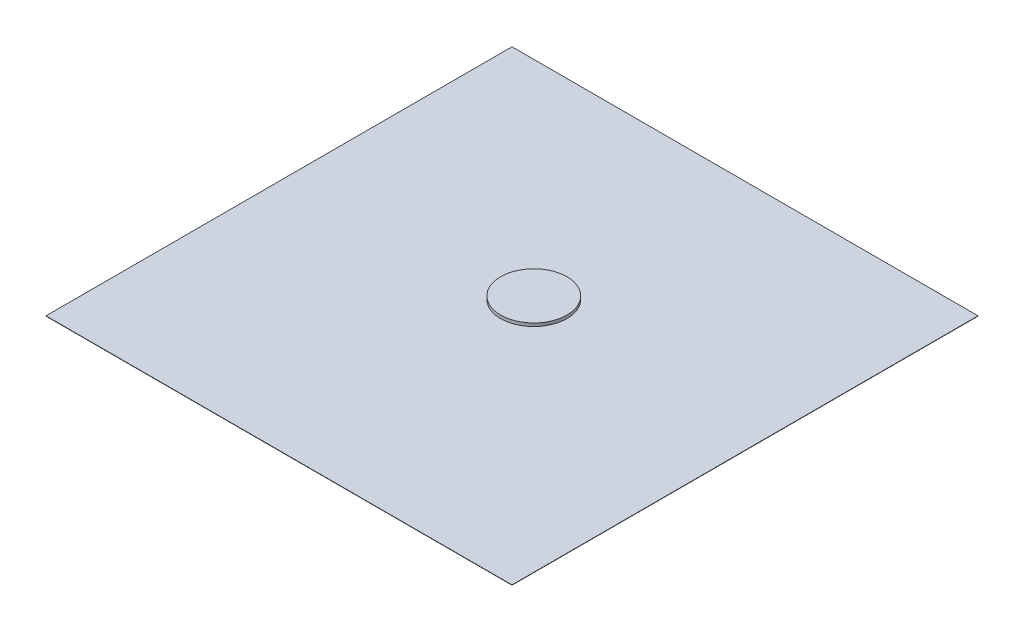
ISO-10303-21;
HEADER;
FILE_DESCRIPTION(('STEP AP214'),'2;1');
FILE_NAME('part.step','',(''),(''),'','','');
FILE_SCHEMA(('AUTOMOTIVE_DESIGN { 1 0 10303 214 1 1 1 1 }'));
ENDSEC;
DATA;
#1=APPLICATION_CONTEXT('core data for automotive mechanical design processes');
#2=APPLICATION_PROTOCOL_DEFINITION('international standard','automotive_design',2000,#1);
#3=PRODUCT_CONTEXT('',#1,'mechanical');
#4=PRODUCT('Part','Part','',(#3));
#5=PRODUCT_RELATED_PRODUCT_CATEGORY('part','',(#4));
#6=PRODUCT_DEFINITION_FORMATION('','',#4);
#7=PRODUCT_DEFINITION_CONTEXT('part definition',#1,'design');
#8=PRODUCT_DEFINITION('design','',#6,#7);
#9=PRODUCT_DEFINITION_SHAPE('','',#8);
#10=(LENGTH_UNIT() NAMED_UNIT(*) SI_UNIT(.MILLI.,.METRE.));
#11=(NAMED_UNIT(*) PLANE_ANGLE_UNIT() SI_UNIT($,.RADIAN.));
#12=(NAMED_UNIT(*) SI_UNIT($,.STERADIAN.) SOLID_ANGLE_UNIT());
#13=UNCERTAINTY_MEASURE_WITH_UNIT(LENGTH_MEASURE(1.E-05),#10,'distance_accuracy_value','');
#14=(GEOMETRIC_REPRESENTATION_CONTEXT(3) GLOBAL_UNCERTAINTY_ASSIGNED_CONTEXT((#13)) GLOBAL_UNIT_ASSIGNED_CONTEXT((#10,
#11,#12)) REPRESENTATION_CONTEXT('',''));
#15=CARTESIAN_POINT('',(0.,0.,0.));
#16=DIRECTION('',(0.,0.,1.));
#17=DIRECTION('',(1.,0.,0.));
#18=AXIS2_PLACEMENT_3D('',#15,#16,#17);
#19=CARTESIAN_POINT('',(0.,1.,0.));
#20=DIRECTION('',(1.,0.,0.));
#21=DIRECTION('',(0.,0.,-1.));
#22=AXIS2_PLACEMENT_3D('',#19,#20,#21);
#23=PLANE('',#22);
#24=DIRECTION('',(0.,0.,1.));
#25=VECTOR('',#24,1.);
#26=CARTESIAN_POINT('',(0.,0.,0.));
#27=LINE('',#26,#25);
#28=CARTESIAN_POINT('',(0.,0.,-1500.));
#29=VERTEX_POINT('',#28);
#30=CARTESIAN_POINT('',(0.,0.,0.));
#31=VERTEX_POINT('',#30);
#32=EDGE_CURVE('E105',#29,#31,#27,.T.);
#33=ORIENTED_EDGE('',*,*,#32,.T.);
#34=DIRECTION('',(0.,-1.,0.));
#35=VECTOR('',#34,1.);
#36=CARTESIAN_POINT('',(0.,1.,0.));
#37=LINE('',#36,#35);
#38=CARTESIAN_POINT('',(0.,1.,0.));
#39=VERTEX_POINT('',#38);
#40=EDGE_CURVE('E47',#39,#31,#37,.T.);
#41=ORIENTED_EDGE('',*,*,#40,.F.);
#42=DIRECTION('',(0.,0.,1.));
#43=VECTOR('',#42,1.);
#44=CARTESIAN_POINT('',(0.,1.,0.));
#45=LINE('',#44,#43);
#46=CARTESIAN_POINT('',(0.,1.,-1500.));
#47=VERTEX_POINT('',#46);
#48=EDGE_CURVE('E91',#47,#39,#45,.T.);
#49=ORIENTED_EDGE('',*,*,#48,.F.);
#50=DIRECTION('',(0.,-1.,0.));
#51=VECTOR('',#50,1.);
#52=CARTESIAN_POINT('',(0.,1.,-1500.));
#53=LINE('',#52,#51);
#54=EDGE_CURVE('E101',#47,#29,#53,.T.);
#55=ORIENTED_EDGE('',*,*,#54,.T.);
#56=EDGE_LOOP('',(#33,#41,#49,#55));
#57=FACE_BOUND('',#56,.T.);
#58=ADVANCED_FACE('F39',(#57),#23,.F.);
#59=CARTESIAN_POINT('',(0.,1.,0.));
#60=DIRECTION('',(0.,0.,-1.));
#61=DIRECTION('',(-1.,0.,0.));
#62=AXIS2_PLACEMENT_3D('',#59,#60,#61);
#63=PLANE('',#62);
#64=DIRECTION('',(1.,0.,0.));
#65=VECTOR('',#64,1.);
#66=CARTESIAN_POINT('',(0.,0.,0.));
#67=LINE('',#66,#65);
#68=CARTESIAN_POINT('',(1500.,0.,0.));
#69=VERTEX_POINT('',#68);
#70=EDGE_CURVE('E96',#31,#69,#67,.T.);
#71=ORIENTED_EDGE('',*,*,#70,.T.);
#72=DIRECTION('',(0.,-1.,0.));
#73=VECTOR('',#72,1.);
#74=CARTESIAN_POINT('',(1500.,1.,0.));
#75=LINE('',#74,#73);
#76=CARTESIAN_POINT('',(1500.,1.,0.));
#77=VERTEX_POINT('',#76);
#78=EDGE_CURVE('E94',#77,#69,#75,.T.);
#79=ORIENTED_EDGE('',*,*,#78,.F.);
#80=DIRECTION('',(1.,0.,0.));
#81=VECTOR('',#80,1.);
#82=CARTESIAN_POINT('',(0.,1.,0.));
#83=LINE('',#82,#81);
#84=EDGE_CURVE('E86',#39,#77,#83,.T.);
#85=ORIENTED_EDGE('',*,*,#84,.F.);
#86=ORIENTED_EDGE('',*,*,#40,.T.);
#87=EDGE_LOOP('',(#71,#79,#85,#86));
#88=FACE_BOUND('',#87,.T.);
#89=ADVANCED_FACE('F95',(#88),#63,.F.);
#90=CARTESIAN_POINT('',(1500.,1.,0.));
#91=DIRECTION('',(-1.,0.,0.));
#92=DIRECTION('',(0.,0.,1.));
#93=AXIS2_PLACEMENT_3D('',#90,#91,#92);
#94=PLANE('',#93);
#95=DIRECTION('',(0.,0.,-1.));
#96=VECTOR('',#95,1.);
#97=CARTESIAN_POINT('',(1500.,0.,0.));
#98=LINE('',#97,#96);
#99=CARTESIAN_POINT('',(1500.,0.,-1500.));
#100=VERTEX_POINT('',#99);
#101=EDGE_CURVE('E72',#69,#100,#98,.T.);
#102=ORIENTED_EDGE('',*,*,#101,.T.);
#103=DIRECTION('',(0.,-1.,0.));
#104=VECTOR('',#103,1.);
#105=CARTESIAN_POINT('',(1500.,1.,-1500.));
#106=LINE('',#105,#104);
#107=CARTESIAN_POINT('',(1500.,1.,-1500.));
#108=VERTEX_POINT('',#107);
#109=EDGE_CURVE('E97',#108,#100,#106,.T.);
#110=ORIENTED_EDGE('',*,*,#109,.F.);
#111=DIRECTION('',(0.,0.,-1.));
#112=VECTOR('',#111,1.);
#113=CARTESIAN_POINT('',(1500.,1.,0.));
#114=LINE('',#113,#112);
#115=EDGE_CURVE('E89',#77,#108,#114,.T.);
#116=ORIENTED_EDGE('',*,*,#115,.F.);
#117=ORIENTED_EDGE('',*,*,#78,.T.);
#118=EDGE_LOOP('',(#102,#110,#116,#117));
#119=FACE_BOUND('',#118,.T.);
#120=ADVANCED_FACE('F99',(#119),#94,.F.);
#121=CARTESIAN_POINT('',(0.,1.,-1500.));
#122=DIRECTION('',(0.,0.,1.));
#123=DIRECTION('',(1.,0.,0.));
#124=AXIS2_PLACEMENT_3D('',#121,#122,#123);
#125=PLANE('',#124);
#126=DIRECTION('',(-1.,0.,0.));
#127=VECTOR('',#126,1.);
#128=CARTESIAN_POINT('',(0.,0.,-1500.));
#129=LINE('',#128,#127);
#130=EDGE_CURVE('E78',#100,#29,#129,.T.);
#131=ORIENTED_EDGE('',*,*,#130,.T.);
#132=ORIENTED_EDGE('',*,*,#54,.F.);
#133=DIRECTION('',(-1.,0.,0.));
#134=VECTOR('',#133,1.);
#135=CARTESIAN_POINT('',(0.,1.,-1500.));
#136=LINE('',#135,#134);
#137=EDGE_CURVE('E55',#108,#47,#136,.T.);
#138=ORIENTED_EDGE('',*,*,#137,.F.);
#139=ORIENTED_EDGE('',*,*,#109,.T.);
#140=EDGE_LOOP('',(#131,#132,#138,#139));
#141=FACE_BOUND('',#140,.T.);
#142=ADVANCED_FACE('F128',(#141),#125,.F.);
#143=CARTESIAN_POINT('',(0.,1.,0.));
#144=DIRECTION('',(0.,-1.,0.));
#145=DIRECTION('',(0.,0.,-1.));
#146=AXIS2_PLACEMENT_3D('',#143,#144,#145);
#147=PLANE('',#146);
#148=CARTESIAN_POINT('',(739.52799832448,1.,-830.634412901506));
#149=DIRECTION('',(0.,-1.,0.));
#150=DIRECTION('',(0.,0.,-1.));
#151=AXIS2_PLACEMENT_3D('',#148,#149,#150);
#152=CIRCLE('',#151,106.814417090307);
#153=CARTESIAN_POINT('',(739.52799832448,1.,-937.448829991813));
#154=VERTEX_POINT('',#153);
#155=EDGE_CURVE('E11',#154,#154,#152,.F.);
#156=ORIENTED_EDGE('',*,*,#155,.F.);
#157=EDGE_LOOP('',(#156));
#158=FACE_BOUND('',#157,.T.);
#159=ORIENTED_EDGE('',*,*,#48,.T.);
#160=ORIENTED_EDGE('',*,*,#84,.T.);
#161=ORIENTED_EDGE('',*,*,#115,.T.);
#162=ORIENTED_EDGE('',*,*,#137,.T.);
#163=EDGE_LOOP('',(#159,#160,#161,#162));
#164=FACE_BOUND('',#163,.T.);
#165=ADVANCED_FACE('F87',(#158,#164),#147,.F.);
#166=CARTESIAN_POINT('',(0.,0.,0.));
#167=DIRECTION('',(0.,-1.,0.));
#168=DIRECTION('',(0.,0.,-1.));
#169=AXIS2_PLACEMENT_3D('',#166,#167,#168);
#170=PLANE('',#169);
#171=ORIENTED_EDGE('',*,*,#32,.F.);
#172=ORIENTED_EDGE('',*,*,#130,.F.);
#173=ORIENTED_EDGE('',*,*,#101,.F.);
#174=ORIENTED_EDGE('',*,*,#70,.F.);
#175=EDGE_LOOP('',(#171,#172,#173,#174));
#176=FACE_BOUND('',#175,.T.);
#177=ADVANCED_FACE('F116',(#176),#170,.T.);
#178=CARTESIAN_POINT('',(739.52799832448,11.,-830.634412901506));
#179=DIRECTION('',(0.,-1.,0.));
#180=DIRECTION('',(0.,0.,-1.));
#181=AXIS2_PLACEMENT_3D('',#178,#179,#180);
#182=CYLINDRICAL_SURFACE('',#181,106.814417090307);
#183=CARTESIAN_POINT('',(739.52799832448,11.,-830.634412901506));
#184=DIRECTION('',(0.,1.,0.));
#185=DIRECTION('',(0.,0.,1.));
#186=AXIS2_PLACEMENT_3D('',#183,#184,#185);
#187=CIRCLE('',#186,106.814417090307);
#188=CARTESIAN_POINT('',(739.52799832448,11.,-723.819995811199));
#189=VERTEX_POINT('',#188);
#190=EDGE_CURVE('E108',#189,#189,#187,.T.);
#191=ORIENTED_EDGE('',*,*,#190,.F.);
#192=EDGE_LOOP('',(#191));
#193=FACE_BOUND('',#192,.T.);
#194=ORIENTED_EDGE('',*,*,#155,.T.);
#195=EDGE_LOOP('',(#194));
#196=FACE_BOUND('',#195,.T.);
#197=ADVANCED_FACE('F118',(#193,#196),#182,.T.);
#198=CARTESIAN_POINT('',(739.52799832448,11.,-830.634412901506));
#199=DIRECTION('',(0.,1.,0.));
#200=DIRECTION('',(0.,0.,1.));
#201=AXIS2_PLACEMENT_3D('',#198,#199,#200);
#202=PLANE('',#201);
#203=ORIENTED_EDGE('',*,*,#190,.T.);
#204=EDGE_LOOP('',(#203));
#205=FACE_BOUND('',#204,.T.);
#206=ADVANCED_FACE('F124',(#205),#202,.T.);
#207=CLOSED_SHELL('',(#58,#89,#120,#142,#165,#177,#197,#206));
#208=MANIFOLD_SOLID_BREP('B2',#207);
#209=ADVANCED_BREP_SHAPE_REPRESENTATION('',(#18,#208),#14);
#210=SHAPE_DEFINITION_REPRESENTATION(#9,#209);
ENDSEC;
END-ISO-10303-21;
